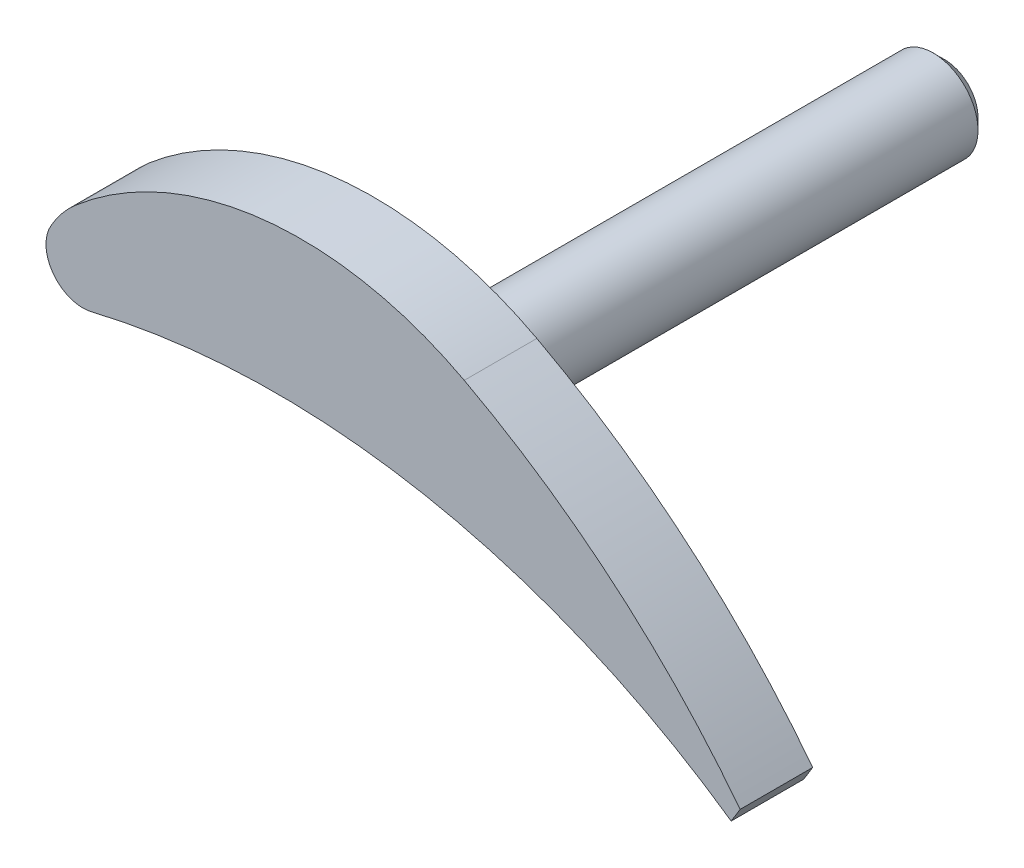
ISO-10303-21;
HEADER;
FILE_DESCRIPTION(('STEP AP214'),'2;1');
FILE_NAME('part.step','',(''),(''),'','','');
FILE_SCHEMA(('AUTOMOTIVE_DESIGN { 1 0 10303 214 1 1 1 1 }'));
ENDSEC;
DATA;
#1=APPLICATION_CONTEXT('core data for automotive mechanical design processes');
#2=APPLICATION_PROTOCOL_DEFINITION('international standard','automotive_design',2000,#1);
#3=PRODUCT_CONTEXT('',#1,'mechanical');
#4=PRODUCT('Part','Part','',(#3));
#5=PRODUCT_RELATED_PRODUCT_CATEGORY('part','',(#4));
#6=PRODUCT_DEFINITION_FORMATION('','',#4);
#7=PRODUCT_DEFINITION_CONTEXT('part definition',#1,'design');
#8=PRODUCT_DEFINITION('design','',#6,#7);
#9=PRODUCT_DEFINITION_SHAPE('','',#8);
#10=(LENGTH_UNIT() NAMED_UNIT(*) SI_UNIT(.MILLI.,.METRE.));
#11=(NAMED_UNIT(*) PLANE_ANGLE_UNIT() SI_UNIT($,.RADIAN.));
#12=(NAMED_UNIT(*) SI_UNIT($,.STERADIAN.) SOLID_ANGLE_UNIT());
#13=UNCERTAINTY_MEASURE_WITH_UNIT(LENGTH_MEASURE(1.E-05),#10,'distance_accuracy_value','');
#14=(GEOMETRIC_REPRESENTATION_CONTEXT(3) GLOBAL_UNCERTAINTY_ASSIGNED_CONTEXT((#13)) GLOBAL_UNIT_ASSIGNED_CONTEXT((#10,
#11,#12)) REPRESENTATION_CONTEXT('',''));
#15=CARTESIAN_POINT('',(0.,0.,0.));
#16=DIRECTION('',(0.,0.,1.));
#17=DIRECTION('',(1.,0.,0.));
#18=AXIS2_PLACEMENT_3D('',#15,#16,#17);
#19=CARTESIAN_POINT('',(-29.8629749125575,-4.25723494919425,6.49999999999987));
#20=DIRECTION('',(0.,0.,-0.999999999999989));
#21=DIRECTION('',(-1.00000000000001,0.,0.));
#22=AXIS2_PLACEMENT_3D('',#19,#20,#21);
#23=CYLINDRICAL_SURFACE('',#22,3.3);
#24=CARTESIAN_POINT('',(-29.8629749125575,-4.25723494919425,0.));
#25=DIRECTION('',(0.,0.,0.999999999999989));
#26=DIRECTION('',(1.00000000000001,0.,0.));
#27=AXIS2_PLACEMENT_3D('',#24,#25,#26);
#28=CIRCLE('',#27,3.3);
#29=CARTESIAN_POINT('',(-32.7507088247125,-2.66005216297651,0.));
#30=VERTEX_POINT('',#29);
#31=CARTESIAN_POINT('',(-29.0918064440321,-7.46586381416953,0.));
#32=VERTEX_POINT('',#31);
#33=EDGE_CURVE('E133',#30,#32,#28,.T.);
#34=ORIENTED_EDGE('',*,*,#33,.T.);
#35=DIRECTION('',(0.,0.,-0.999999999999989));
#36=VECTOR('',#35,1.);
#37=CARTESIAN_POINT('',(-29.0918064440321,-7.46586381416953,6.49999999999987));
#38=LINE('',#37,#36);
#39=CARTESIAN_POINT('',(-29.0918064440321,-7.46586381416953,6.49999999999987));
#40=VERTEX_POINT('',#39);
#41=EDGE_CURVE('E160',#40,#32,#38,.T.);
#42=ORIENTED_EDGE('',*,*,#41,.F.);
#43=CARTESIAN_POINT('',(-29.8629749125575,-4.25723494919425,6.49999999999987));
#44=DIRECTION('',(0.,0.,0.999999999999989));
#45=DIRECTION('',(1.00000000000001,0.,0.));
#46=AXIS2_PLACEMENT_3D('',#43,#44,#45);
#47=CIRCLE('',#46,3.3);
#48=CARTESIAN_POINT('',(-32.7507088247125,-2.66005216297651,6.49999999999987));
#49=VERTEX_POINT('',#48);
#50=EDGE_CURVE('E149',#49,#40,#47,.T.);
#51=ORIENTED_EDGE('',*,*,#50,.F.);
#52=DIRECTION('',(0.,0.,-0.999999999999989));
#53=VECTOR('',#52,1.);
#54=CARTESIAN_POINT('',(-32.7507088247125,-2.66005216297651,6.49999999999987));
#55=LINE('',#54,#53);
#56=EDGE_CURVE('E129',#49,#30,#55,.T.);
#57=ORIENTED_EDGE('',*,*,#56,.T.);
#58=EDGE_LOOP('',(#34,#42,#51,#57));
#59=FACE_BOUND('',#58,.T.);
#60=ADVANCED_FACE('F40',(#59),#23,.T.);
#61=CARTESIAN_POINT('',(-12.5000000000003,-76.5000000000011,6.49999999999987));
#62=DIRECTION('',(0.,0.,-0.999999999999989));
#63=DIRECTION('',(-1.00000000000001,0.,0.));
#64=AXIS2_PLACEMENT_3D('',#61,#62,#63);
#65=CYLINDRICAL_SURFACE('',#64,71.);
#66=CARTESIAN_POINT('',(-12.5000000000003,-76.5000000000011,0.));
#67=DIRECTION('',(0.,0.,-0.999999999999989));
#68=DIRECTION('',(-1.00000000000001,0.,0.));
#69=AXIS2_PLACEMENT_3D('',#66,#67,#68);
#70=CIRCLE('',#69,71.);
#71=CARTESIAN_POINT('',(28.1968527645,-18.3212566733811,0.));
#72=VERTEX_POINT('',#71);
#73=EDGE_CURVE('E137',#32,#72,#70,.T.);
#74=ORIENTED_EDGE('',*,*,#73,.T.);
#75=DIRECTION('',(0.,0.,-0.999999999999989));
#76=VECTOR('',#75,1.);
#77=CARTESIAN_POINT('',(28.1968527645,-18.3212566733811,6.49999999999987));
#78=LINE('',#77,#76);
#79=CARTESIAN_POINT('',(28.1968527645,-18.3212566733811,6.49999999999987));
#80=VERTEX_POINT('',#79);
#81=EDGE_CURVE('E156',#80,#72,#78,.T.);
#82=ORIENTED_EDGE('',*,*,#81,.F.);
#83=CARTESIAN_POINT('',(-12.5000000000003,-76.5000000000011,6.49999999999987));
#84=DIRECTION('',(0.,0.,-0.999999999999989));
#85=DIRECTION('',(-1.00000000000001,0.,0.));
#86=AXIS2_PLACEMENT_3D('',#83,#84,#85);
#87=CIRCLE('',#86,71.);
#88=EDGE_CURVE('E97',#40,#80,#87,.T.);
#89=ORIENTED_EDGE('',*,*,#88,.F.);
#90=ORIENTED_EDGE('',*,*,#41,.T.);
#91=EDGE_LOOP('',(#74,#82,#89,#90));
#92=FACE_BOUND('',#91,.T.);
#93=ADVANCED_FACE('F182',(#92),#65,.F.);
#94=CARTESIAN_POINT('',(28.1968527645,-18.3212566733811,6.49999999999987));
#95=DIRECTION('',(-0.852640164354105,0.522498564715954,0.));
#96=DIRECTION('',(-0.522498564715954,-0.852640164354104,0.));
#97=AXIS2_PLACEMENT_3D('',#94,#95,#96);
#98=PLANE('',#97);
#99=DIRECTION('',(0.522498564715954,0.852640164354105,0.));
#100=VECTOR('',#99,1.);
#101=CARTESIAN_POINT('',(28.1968527645,-18.3212566733811,0.));
#102=LINE('',#101,#100);
#103=CARTESIAN_POINT('',(29.0000000000004,-17.0106395021171,0.));
#104=VERTEX_POINT('',#103);
#105=EDGE_CURVE('E140',#72,#104,#102,.T.);
#106=ORIENTED_EDGE('',*,*,#105,.T.);
#107=DIRECTION('',(0.,0.,-0.999999999999989));
#108=VECTOR('',#107,1.);
#109=CARTESIAN_POINT('',(29.0000000000004,-17.0106395021171,6.49999999999987));
#110=LINE('',#109,#108);
#111=CARTESIAN_POINT('',(29.0000000000004,-17.0106395021171,6.49999999999987));
#112=VERTEX_POINT('',#111);
#113=EDGE_CURVE('E121',#112,#104,#110,.T.);
#114=ORIENTED_EDGE('',*,*,#113,.F.);
#115=DIRECTION('',(0.522498564715954,0.852640164354105,0.));
#116=VECTOR('',#115,1.);
#117=CARTESIAN_POINT('',(28.1968527645,-18.3212566733811,6.49999999999987));
#118=LINE('',#117,#116);
#119=EDGE_CURVE('E110',#80,#112,#118,.T.);
#120=ORIENTED_EDGE('',*,*,#119,.F.);
#121=ORIENTED_EDGE('',*,*,#81,.T.);
#122=EDGE_LOOP('',(#106,#114,#120,#121));
#123=FACE_BOUND('',#122,.T.);
#124=ADVANCED_FACE('F187',(#123),#98,.F.);
#125=CARTESIAN_POINT('',(-32.0000000000005,-64.0000000000008,6.49999999999987));
#126=DIRECTION('',(0.,0.,-0.999999999999989));
#127=DIRECTION('',(-1.00000000000001,0.,0.));
#128=AXIS2_PLACEMENT_3D('',#125,#126,#127);
#129=CYLINDRICAL_SURFACE('',#128,77.);
#130=CARTESIAN_POINT('',(-32.0000000000005,-64.0000000000008,0.));
#131=DIRECTION('',(0.,0.,0.999999999999989));
#132=DIRECTION('',(1.00000000000001,0.,0.));
#133=AXIS2_PLACEMENT_3D('',#130,#131,#132);
#134=CIRCLE('',#133,77.);
#135=CARTESIAN_POINT('',(4.2947108056831,3.90945418372796,0.));
#136=VERTEX_POINT('',#135);
#137=EDGE_CURVE('E119',#104,#136,#134,.T.);
#138=ORIENTED_EDGE('',*,*,#137,.T.);
#139=DIRECTION('',(0.,0.,-0.999999999999989));
#140=VECTOR('',#139,1.);
#141=CARTESIAN_POINT('',(4.2947108056831,3.90945418372796,6.49999999999987));
#142=LINE('',#141,#140);
#143=CARTESIAN_POINT('',(4.2947108056831,3.90945418372796,6.49999999999987));
#144=VERTEX_POINT('',#143);
#145=EDGE_CURVE('E116',#144,#136,#142,.T.);
#146=ORIENTED_EDGE('',*,*,#145,.F.);
#147=CARTESIAN_POINT('',(-32.0000000000005,-64.0000000000008,6.49999999999987));
#148=DIRECTION('',(0.,0.,0.999999999999989));
#149=DIRECTION('',(1.00000000000001,0.,0.));
#150=AXIS2_PLACEMENT_3D('',#147,#148,#149);
#151=CIRCLE('',#150,77.);
#152=EDGE_CURVE('E104',#112,#144,#151,.T.);
#153=ORIENTED_EDGE('',*,*,#152,.F.);
#154=ORIENTED_EDGE('',*,*,#113,.T.);
#155=EDGE_LOOP('',(#138,#146,#153,#154));
#156=FACE_BOUND('',#155,.T.);
#157=ADVANCED_FACE('F117',(#156),#129,.T.);
#158=CARTESIAN_POINT('',(-10.3174454927089,-23.4307156824485,6.49999999999987));
#159=DIRECTION('',(0.,0.,-0.999999999999989));
#160=DIRECTION('',(-1.00000000000001,0.,0.));
#161=AXIS2_PLACEMENT_3D('',#158,#159,#160);
#162=CYLINDRICAL_SURFACE('',#161,31.);
#163=CARTESIAN_POINT('',(-10.3174454927089,-23.4307156824485,0.));
#164=DIRECTION('',(0.,0.,0.999999999999989));
#165=DIRECTION('',(-1.00000000000001,0.,0.));
#166=AXIS2_PLACEMENT_3D('',#163,#164,#165);
#167=CIRCLE('',#166,31.);
#168=CARTESIAN_POINT('',(-30.5155021463296,0.0860550868802962,0.));
#169=VERTEX_POINT('',#168);
#170=EDGE_CURVE('E82',#136,#169,#167,.T.);
#171=ORIENTED_EDGE('',*,*,#170,.T.);
#172=DIRECTION('',(0.,0.,-0.999999999999989));
#173=VECTOR('',#172,1.);
#174=CARTESIAN_POINT('',(-30.5155021463296,0.0860550868802962,6.49999999999987));
#175=LINE('',#174,#173);
#176=CARTESIAN_POINT('',(-30.5155021463296,0.0860550868802962,6.49999999999987));
#177=VERTEX_POINT('',#176);
#178=EDGE_CURVE('E122',#177,#169,#175,.T.);
#179=ORIENTED_EDGE('',*,*,#178,.F.);
#180=CARTESIAN_POINT('',(-10.3174454927089,-23.4307156824485,6.49999999999987));
#181=DIRECTION('',(0.,0.,0.999999999999989));
#182=DIRECTION('',(-1.00000000000001,0.,0.));
#183=AXIS2_PLACEMENT_3D('',#180,#181,#182);
#184=CIRCLE('',#183,31.);
#185=EDGE_CURVE('E108',#144,#177,#184,.T.);
#186=ORIENTED_EDGE('',*,*,#185,.F.);
#187=ORIENTED_EDGE('',*,*,#145,.T.);
#188=EDGE_LOOP('',(#171,#179,#186,#187));
#189=FACE_BOUND('',#188,.T.);
#190=ADVANCED_FACE('F124',(#189),#162,.T.);
#191=CARTESIAN_POINT('',(-24.0000000000004,-7.49999999999997,6.49999999999987));
#192=DIRECTION('',(0.,0.,-0.999999999999989));
#193=DIRECTION('',(-1.00000000000001,0.,0.));
#194=AXIS2_PLACEMENT_3D('',#191,#192,#193);
#195=CYLINDRICAL_SURFACE('',#194,10.);
#196=CARTESIAN_POINT('',(-24.0000000000004,-7.49999999999997,0.));
#197=DIRECTION('',(0.,0.,0.999999999999989));
#198=DIRECTION('',(-1.00000000000001,0.,0.));
#199=AXIS2_PLACEMENT_3D('',#196,#197,#198);
#200=CIRCLE('',#199,10.);
#201=EDGE_CURVE('E88',#169,#30,#200,.T.);
#202=ORIENTED_EDGE('',*,*,#201,.T.);
#203=ORIENTED_EDGE('',*,*,#56,.F.);
#204=CARTESIAN_POINT('',(-24.0000000000004,-7.49999999999997,6.49999999999987));
#205=DIRECTION('',(0.,0.,0.999999999999989));
#206=DIRECTION('',(-1.00000000000001,0.,0.));
#207=AXIS2_PLACEMENT_3D('',#204,#205,#206);
#208=CIRCLE('',#207,10.);
#209=EDGE_CURVE('E59',#177,#49,#208,.T.);
#210=ORIENTED_EDGE('',*,*,#209,.F.);
#211=ORIENTED_EDGE('',*,*,#178,.T.);
#212=EDGE_LOOP('',(#202,#203,#210,#211));
#213=FACE_BOUND('',#212,.T.);
#214=ADVANCED_FACE('F197',(#213),#195,.T.);
#215=CARTESIAN_POINT('',(-29.8629749125575,-4.25723494919425,6.49999999999987));
#216=DIRECTION('',(0.,0.,0.999999999999989));
#217=DIRECTION('',(1.00000000000001,0.,0.));
#218=AXIS2_PLACEMENT_3D('',#215,#216,#217);
#219=PLANE('',#218);
#220=ORIENTED_EDGE('',*,*,#50,.T.);
#221=ORIENTED_EDGE('',*,*,#88,.T.);
#222=ORIENTED_EDGE('',*,*,#119,.T.);
#223=ORIENTED_EDGE('',*,*,#152,.T.);
#224=ORIENTED_EDGE('',*,*,#185,.T.);
#225=ORIENTED_EDGE('',*,*,#209,.T.);
#226=EDGE_LOOP('',(#220,#221,#222,#223,#224,#225));
#227=FACE_BOUND('',#226,.T.);
#228=ADVANCED_FACE('F106',(#227),#219,.T.);
#229=CARTESIAN_POINT('',(-29.8629749125575,-4.25723494919425,0.));
#230=DIRECTION('',(0.,0.,0.999999999999989));
#231=DIRECTION('',(1.00000000000001,0.,0.));
#232=AXIS2_PLACEMENT_3D('',#229,#230,#231);
#233=PLANE('',#232);
#234=CARTESIAN_POINT('',(0.,0.,0.));
#235=DIRECTION('',(0.,0.,0.999999999999989));
#236=DIRECTION('',(1.00000000000001,0.,0.));
#237=AXIS2_PLACEMENT_3D('',#234,#235,#236);
#238=CIRCLE('',#237,4.);
#239=CARTESIAN_POINT('',(4.00000000000005,0.,0.));
#240=VERTEX_POINT('',#239);
#241=EDGE_CURVE('E163',#240,#240,#238,.F.);
#242=ORIENTED_EDGE('',*,*,#241,.F.);
#243=EDGE_LOOP('',(#242));
#244=FACE_BOUND('',#243,.T.);
#245=ORIENTED_EDGE('',*,*,#33,.F.);
#246=ORIENTED_EDGE('',*,*,#201,.F.);
#247=ORIENTED_EDGE('',*,*,#170,.F.);
#248=ORIENTED_EDGE('',*,*,#137,.F.);
#249=ORIENTED_EDGE('',*,*,#105,.F.);
#250=ORIENTED_EDGE('',*,*,#73,.F.);
#251=EDGE_LOOP('',(#245,#246,#247,#248,#249,#250));
#252=FACE_BOUND('',#251,.T.);
#253=ADVANCED_FACE('F200',(#244,#252),#233,.F.);
#254=CARTESIAN_POINT('',(0.,0.,-40.7999999999994));
#255=DIRECTION('',(0.,0.,0.999999999999989));
#256=DIRECTION('',(1.00000000000001,0.,0.));
#257=AXIS2_PLACEMENT_3D('',#254,#255,#256);
#258=CYLINDRICAL_SURFACE('',#257,4.);
#259=CARTESIAN_POINT('',(0.,0.,-39.7999999999994));
#260=DIRECTION('',(0.,0.,-0.999999999999989));
#261=DIRECTION('',(-1.00000000000001,0.,0.));
#262=AXIS2_PLACEMENT_3D('',#259,#260,#261);
#263=CIRCLE('',#262,4.);
#264=CARTESIAN_POINT('',(-4.00000000000005,0.,-39.7999999999994));
#265=VERTEX_POINT('',#264);
#266=EDGE_CURVE('E11',#265,#265,#263,.F.);
#267=ORIENTED_EDGE('',*,*,#266,.T.);
#268=EDGE_LOOP('',(#267));
#269=FACE_BOUND('',#268,.T.);
#270=ORIENTED_EDGE('',*,*,#241,.T.);
#271=EDGE_LOOP('',(#270));
#272=FACE_BOUND('',#271,.T.);
#273=ADVANCED_FACE('F178',(#269,#272),#258,.T.);
#274=CARTESIAN_POINT('',(0.,0.,-40.7999999999994));
#275=DIRECTION('',(0.,0.,-0.999999999999989));
#276=DIRECTION('',(-1.00000000000001,0.,0.));
#277=AXIS2_PLACEMENT_3D('',#274,#275,#276);
#278=PLANE('',#277);
#279=CARTESIAN_POINT('',(0.,0.,-40.7999999999994));
#280=DIRECTION('',(0.,0.,-0.999999999999989));
#281=DIRECTION('',(-1.00000000000001,0.,0.));
#282=AXIS2_PLACEMENT_3D('',#279,#280,#281);
#283=CIRCLE('',#282,3.00000000000002);
#284=CARTESIAN_POINT('',(-3.00000000000006,0.,-40.7999999999994));
#285=VERTEX_POINT('',#284);
#286=EDGE_CURVE('E51',#285,#285,#283,.T.);
#287=ORIENTED_EDGE('',*,*,#286,.T.);
#288=EDGE_LOOP('',(#287));
#289=FACE_BOUND('',#288,.T.);
#290=ADVANCED_FACE('F171',(#289),#278,.T.);
#291=CARTESIAN_POINT('',(0.,0.,-40.7999999999994));
#292=DIRECTION('',(0.,0.,0.999999999999989));
#293=DIRECTION('',(1.00000000000001,0.,0.));
#294=AXIS2_PLACEMENT_3D('',#291,#292,#293);
#295=CONICAL_SURFACE('',#294,3.00000000000002,0.785398163397443);
#296=ORIENTED_EDGE('',*,*,#266,.F.);
#297=EDGE_LOOP('',(#296));
#298=FACE_BOUND('',#297,.T.);
#299=ORIENTED_EDGE('',*,*,#286,.F.);
#300=EDGE_LOOP('',(#299));
#301=FACE_BOUND('',#300,.T.);
#302=ADVANCED_FACE('F43',(#298,#301),#295,.T.);
#303=CLOSED_SHELL('',(#60,#93,#124,#157,#190,#214,#228,#253,#273,#290,#302));
#304=MANIFOLD_SOLID_BREP('B2',#303);
#305=ADVANCED_BREP_SHAPE_REPRESENTATION('',(#18,#304),#14);
#306=SHAPE_DEFINITION_REPRESENTATION(#9,#305);
ENDSEC;
END-ISO-10303-21;
